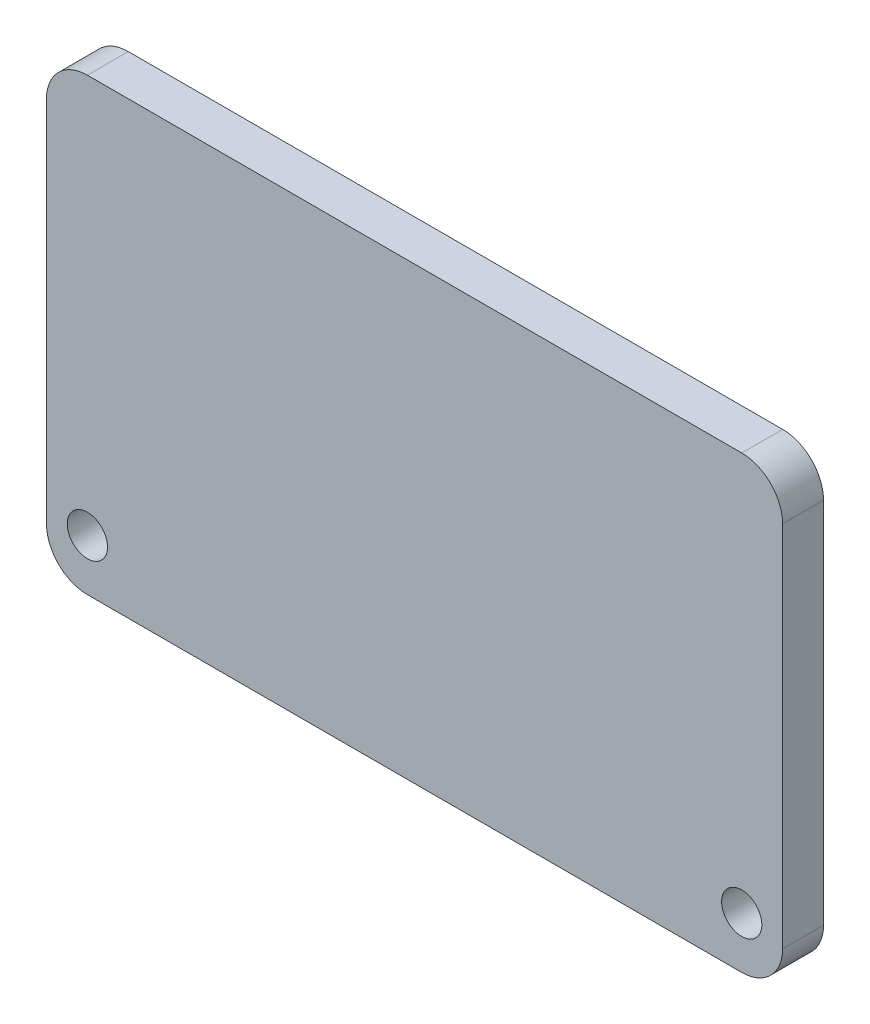
ISO-10303-21;
HEADER;
FILE_DESCRIPTION(('STEP AP214'),'2;1');
FILE_NAME('part.step','',(''),(''),'','','');
FILE_SCHEMA(('AUTOMOTIVE_DESIGN { 1 0 10303 214 1 1 1 1 }'));
ENDSEC;
DATA;
#1=APPLICATION_CONTEXT('core data for automotive mechanical design processes');
#2=APPLICATION_PROTOCOL_DEFINITION('international standard','automotive_design',2000,#1);
#3=PRODUCT_CONTEXT('',#1,'mechanical');
#4=PRODUCT('Part','Part','',(#3));
#5=PRODUCT_RELATED_PRODUCT_CATEGORY('part','',(#4));
#6=PRODUCT_DEFINITION_FORMATION('','',#4);
#7=PRODUCT_DEFINITION_CONTEXT('part definition',#1,'design');
#8=PRODUCT_DEFINITION('design','',#6,#7);
#9=PRODUCT_DEFINITION_SHAPE('','',#8);
#10=(LENGTH_UNIT() NAMED_UNIT(*) SI_UNIT(.MILLI.,.METRE.));
#11=(NAMED_UNIT(*) PLANE_ANGLE_UNIT() SI_UNIT($,.RADIAN.));
#12=(NAMED_UNIT(*) SI_UNIT($,.STERADIAN.) SOLID_ANGLE_UNIT());
#13=UNCERTAINTY_MEASURE_WITH_UNIT(LENGTH_MEASURE(1.E-05),#10,'distance_accuracy_value','');
#14=(GEOMETRIC_REPRESENTATION_CONTEXT(3) GLOBAL_UNCERTAINTY_ASSIGNED_CONTEXT((#13)) GLOBAL_UNIT_ASSIGNED_CONTEXT((#10,
#11,#12)) REPRESENTATION_CONTEXT('',''));
#15=CARTESIAN_POINT('',(0.,0.,0.));
#16=DIRECTION('',(0.,0.,1.));
#17=DIRECTION('',(1.,0.,0.));
#18=AXIS2_PLACEMENT_3D('',#15,#16,#17);
#19=CARTESIAN_POINT('',(22.86,-13.97,1.27));
#20=DIRECTION('',(-1.,0.,0.));
#21=DIRECTION('',(0.,0.,1.));
#22=AXIS2_PLACEMENT_3D('',#19,#20,#21);
#23=PLANE('',#22);
#24=DIRECTION('',(0.,1.,0.));
#25=VECTOR('',#24,1.);
#26=CARTESIAN_POINT('',(22.86,-13.97,-1.27));
#27=LINE('',#26,#25);
#28=CARTESIAN_POINT('',(22.86,-11.43,-1.27));
#29=VERTEX_POINT('',#28);
#30=CARTESIAN_POINT('',(22.86,11.43,-1.27));
#31=VERTEX_POINT('',#30);
#32=EDGE_CURVE('E126',#29,#31,#27,.T.);
#33=ORIENTED_EDGE('',*,*,#32,.T.);
#34=DIRECTION('',(0.,0.,-1.));
#35=VECTOR('',#34,1.);
#36=CARTESIAN_POINT('',(22.86,11.43,1.27));
#37=LINE('',#36,#35);
#38=CARTESIAN_POINT('',(22.86,11.43,1.27));
#39=VERTEX_POINT('',#38);
#40=EDGE_CURVE('E104',#31,#39,#37,.F.);
#41=ORIENTED_EDGE('',*,*,#40,.T.);
#42=DIRECTION('',(0.,1.,0.));
#43=VECTOR('',#42,1.);
#44=CARTESIAN_POINT('',(22.86,-13.97,1.27));
#45=LINE('',#44,#43);
#46=CARTESIAN_POINT('',(22.86,-11.43,1.27));
#47=VERTEX_POINT('',#46);
#48=EDGE_CURVE('E136',#47,#39,#45,.T.);
#49=ORIENTED_EDGE('',*,*,#48,.F.);
#50=DIRECTION('',(0.,0.,-1.));
#51=VECTOR('',#50,1.);
#52=CARTESIAN_POINT('',(22.86,-11.43,1.27));
#53=LINE('',#52,#51);
#54=EDGE_CURVE('E109',#47,#29,#53,.T.);
#55=ORIENTED_EDGE('',*,*,#54,.T.);
#56=EDGE_LOOP('',(#33,#41,#49,#55));
#57=FACE_BOUND('',#56,.T.);
#58=ADVANCED_FACE('F33',(#57),#23,.F.);
#59=CARTESIAN_POINT('',(-22.86,13.97,1.27));
#60=DIRECTION('',(0.,-1.,0.));
#61=DIRECTION('',(0.,0.,-1.));
#62=AXIS2_PLACEMENT_3D('',#59,#60,#61);
#63=PLANE('',#62);
#64=DIRECTION('',(-1.,0.,0.));
#65=VECTOR('',#64,1.);
#66=CARTESIAN_POINT('',(-22.86,13.97,1.27));
#67=LINE('',#66,#65);
#68=CARTESIAN_POINT('',(20.32,13.97,1.27));
#69=VERTEX_POINT('',#68);
#70=CARTESIAN_POINT('',(-20.32,13.97,1.27));
#71=VERTEX_POINT('',#70);
#72=EDGE_CURVE('E119',#69,#71,#67,.T.);
#73=ORIENTED_EDGE('',*,*,#72,.F.);
#74=DIRECTION('',(0.,0.,-1.));
#75=VECTOR('',#74,1.);
#76=CARTESIAN_POINT('',(20.32,13.97,1.27));
#77=LINE('',#76,#75);
#78=CARTESIAN_POINT('',(20.32,13.97,-1.27));
#79=VERTEX_POINT('',#78);
#80=EDGE_CURVE('E103',#69,#79,#77,.T.);
#81=ORIENTED_EDGE('',*,*,#80,.T.);
#82=DIRECTION('',(-1.,0.,0.));
#83=VECTOR('',#82,1.);
#84=CARTESIAN_POINT('',(-22.86,13.97,-1.27));
#85=LINE('',#84,#83);
#86=CARTESIAN_POINT('',(-20.32,13.97,-1.27));
#87=VERTEX_POINT('',#86);
#88=EDGE_CURVE('E116',#79,#87,#85,.T.);
#89=ORIENTED_EDGE('',*,*,#88,.T.);
#90=DIRECTION('',(0.,0.,-1.));
#91=VECTOR('',#90,1.);
#92=CARTESIAN_POINT('',(-20.32,13.97,1.27));
#93=LINE('',#92,#91);
#94=EDGE_CURVE('E121',#87,#71,#93,.F.);
#95=ORIENTED_EDGE('',*,*,#94,.T.);
#96=EDGE_LOOP('',(#73,#81,#89,#95));
#97=FACE_BOUND('',#96,.T.);
#98=ADVANCED_FACE('F115',(#97),#63,.F.);
#99=CARTESIAN_POINT('',(-22.86,-13.97,1.27));
#100=DIRECTION('',(1.,0.,0.));
#101=DIRECTION('',(0.,0.,-1.));
#102=AXIS2_PLACEMENT_3D('',#99,#100,#101);
#103=PLANE('',#102);
#104=DIRECTION('',(0.,-1.,0.));
#105=VECTOR('',#104,1.);
#106=CARTESIAN_POINT('',(-22.86,-13.97,-1.27));
#107=LINE('',#106,#105);
#108=CARTESIAN_POINT('',(-22.86,11.43,-1.27));
#109=VERTEX_POINT('',#108);
#110=CARTESIAN_POINT('',(-22.86,-11.43,-1.27));
#111=VERTEX_POINT('',#110);
#112=EDGE_CURVE('E125',#109,#111,#107,.T.);
#113=ORIENTED_EDGE('',*,*,#112,.T.);
#114=DIRECTION('',(0.,0.,-1.));
#115=VECTOR('',#114,1.);
#116=CARTESIAN_POINT('',(-22.86,-11.43,1.27));
#117=LINE('',#116,#115);
#118=CARTESIAN_POINT('',(-22.86,-11.43,1.27));
#119=VERTEX_POINT('',#118);
#120=EDGE_CURVE('E11',#111,#119,#117,.F.);
#121=ORIENTED_EDGE('',*,*,#120,.T.);
#122=DIRECTION('',(0.,-1.,0.));
#123=VECTOR('',#122,1.);
#124=CARTESIAN_POINT('',(-22.86,-13.97,1.27));
#125=LINE('',#124,#123);
#126=CARTESIAN_POINT('',(-22.86,11.43,1.27));
#127=VERTEX_POINT('',#126);
#128=EDGE_CURVE('E162',#127,#119,#125,.T.);
#129=ORIENTED_EDGE('',*,*,#128,.F.);
#130=DIRECTION('',(0.,0.,-1.));
#131=VECTOR('',#130,1.);
#132=CARTESIAN_POINT('',(-22.86,11.43,1.27));
#133=LINE('',#132,#131);
#134=EDGE_CURVE('E41',#127,#109,#133,.T.);
#135=ORIENTED_EDGE('',*,*,#134,.T.);
#136=EDGE_LOOP('',(#113,#121,#129,#135));
#137=FACE_BOUND('',#136,.T.);
#138=ADVANCED_FACE('F160',(#137),#103,.F.);
#139=CARTESIAN_POINT('',(-22.86,-13.97,1.27));
#140=DIRECTION('',(0.,1.,0.));
#141=DIRECTION('',(0.,0.,1.));
#142=AXIS2_PLACEMENT_3D('',#139,#140,#141);
#143=PLANE('',#142);
#144=DIRECTION('',(1.,0.,0.));
#145=VECTOR('',#144,1.);
#146=CARTESIAN_POINT('',(-22.86,-13.97,-1.27));
#147=LINE('',#146,#145);
#148=CARTESIAN_POINT('',(-20.32,-13.97,-1.27));
#149=VERTEX_POINT('',#148);
#150=CARTESIAN_POINT('',(20.32,-13.97,-1.27));
#151=VERTEX_POINT('',#150);
#152=EDGE_CURVE('E129',#149,#151,#147,.T.);
#153=ORIENTED_EDGE('',*,*,#152,.T.);
#154=DIRECTION('',(0.,0.,-1.));
#155=VECTOR('',#154,1.);
#156=CARTESIAN_POINT('',(20.32,-13.97,1.27));
#157=LINE('',#156,#155);
#158=CARTESIAN_POINT('',(20.32,-13.97,1.27));
#159=VERTEX_POINT('',#158);
#160=EDGE_CURVE('E48',#151,#159,#157,.F.);
#161=ORIENTED_EDGE('',*,*,#160,.T.);
#162=DIRECTION('',(1.,0.,0.));
#163=VECTOR('',#162,1.);
#164=CARTESIAN_POINT('',(-22.86,-13.97,1.27));
#165=LINE('',#164,#163);
#166=CARTESIAN_POINT('',(-20.32,-13.97,1.27));
#167=VERTEX_POINT('',#166);
#168=EDGE_CURVE('E137',#167,#159,#165,.T.);
#169=ORIENTED_EDGE('',*,*,#168,.F.);
#170=DIRECTION('',(0.,0.,-1.));
#171=VECTOR('',#170,1.);
#172=CARTESIAN_POINT('',(-20.32,-13.97,1.27));
#173=LINE('',#172,#171);
#174=EDGE_CURVE('E153',#167,#149,#173,.T.);
#175=ORIENTED_EDGE('',*,*,#174,.T.);
#176=EDGE_LOOP('',(#153,#161,#169,#175));
#177=FACE_BOUND('',#176,.T.);
#178=ADVANCED_FACE('F169',(#177),#143,.F.);
#179=CARTESIAN_POINT('',(0.,0.,1.27));
#180=DIRECTION('',(0.,0.,-1.));
#181=DIRECTION('',(-1.,0.,0.));
#182=AXIS2_PLACEMENT_3D('',#179,#180,#181);
#183=PLANE('',#182);
#184=CARTESIAN_POINT('',(20.32,-10.7857920790764,1.27));
#185=DIRECTION('',(0.,0.,1.));
#186=DIRECTION('',(1.,0.,0.));
#187=AXIS2_PLACEMENT_3D('',#184,#185,#186);
#188=CIRCLE('',#187,1.25);
#189=CARTESIAN_POINT('',(21.57,-10.7857920790764,1.27));
#190=VERTEX_POINT('',#189);
#191=EDGE_CURVE('E182',#190,#190,#188,.T.);
#192=ORIENTED_EDGE('',*,*,#191,.F.);
#193=EDGE_LOOP('',(#192));
#194=FACE_BOUND('',#193,.T.);
#195=CARTESIAN_POINT('',(-20.32,-10.7857920790764,1.27));
#196=DIRECTION('',(0.,0.,1.));
#197=DIRECTION('',(1.,0.,0.));
#198=AXIS2_PLACEMENT_3D('',#195,#196,#197);
#199=CIRCLE('',#198,1.25);
#200=CARTESIAN_POINT('',(-19.07,-10.7857920790764,1.27));
#201=VERTEX_POINT('',#200);
#202=EDGE_CURVE('E176',#201,#201,#199,.T.);
#203=ORIENTED_EDGE('',*,*,#202,.F.);
#204=EDGE_LOOP('',(#203));
#205=FACE_BOUND('',#204,.T.);
#206=ORIENTED_EDGE('',*,*,#48,.T.);
#207=CARTESIAN_POINT('',(20.32,11.43,1.27));
#208=DIRECTION('',(0.,0.,-1.));
#209=DIRECTION('',(-1.,0.,0.));
#210=AXIS2_PLACEMENT_3D('',#207,#208,#209);
#211=CIRCLE('',#210,2.54);
#212=EDGE_CURVE('E151',#39,#69,#211,.F.);
#213=ORIENTED_EDGE('',*,*,#212,.T.);
#214=ORIENTED_EDGE('',*,*,#72,.T.);
#215=CARTESIAN_POINT('',(-20.32,11.43,1.27));
#216=DIRECTION('',(0.,0.,-1.));
#217=DIRECTION('',(-1.,0.,0.));
#218=AXIS2_PLACEMENT_3D('',#215,#216,#217);
#219=CIRCLE('',#218,2.54);
#220=EDGE_CURVE('E146',#71,#127,#219,.F.);
#221=ORIENTED_EDGE('',*,*,#220,.T.);
#222=ORIENTED_EDGE('',*,*,#128,.T.);
#223=CARTESIAN_POINT('',(-20.32,-11.43,1.27));
#224=DIRECTION('',(0.,0.,-1.));
#225=DIRECTION('',(-1.,0.,0.));
#226=AXIS2_PLACEMENT_3D('',#223,#224,#225);
#227=CIRCLE('',#226,2.54);
#228=EDGE_CURVE('E55',#119,#167,#227,.F.);
#229=ORIENTED_EDGE('',*,*,#228,.T.);
#230=ORIENTED_EDGE('',*,*,#168,.T.);
#231=CARTESIAN_POINT('',(20.32,-11.43,1.27));
#232=DIRECTION('',(0.,0.,-1.));
#233=DIRECTION('',(-1.,0.,0.));
#234=AXIS2_PLACEMENT_3D('',#231,#232,#233);
#235=CIRCLE('',#234,2.54);
#236=EDGE_CURVE('E149',#159,#47,#235,.F.);
#237=ORIENTED_EDGE('',*,*,#236,.T.);
#238=EDGE_LOOP('',(#206,#213,#214,#221,#222,#229,#230,#237));
#239=FACE_BOUND('',#238,.T.);
#240=ADVANCED_FACE('F197',(#194,#205,#239),#183,.F.);
#241=CARTESIAN_POINT('',(0.,0.,-1.27));
#242=DIRECTION('',(0.,0.,-1.));
#243=DIRECTION('',(-1.,0.,0.));
#244=AXIS2_PLACEMENT_3D('',#241,#242,#243);
#245=PLANE('',#244);
#246=CARTESIAN_POINT('',(20.32,-10.7857920790764,-1.27));
#247=DIRECTION('',(0.,0.,1.));
#248=DIRECTION('',(1.,0.,0.));
#249=AXIS2_PLACEMENT_3D('',#246,#247,#248);
#250=CIRCLE('',#249,1.25);
#251=CARTESIAN_POINT('',(21.57,-10.7857920790764,-1.27));
#252=VERTEX_POINT('',#251);
#253=EDGE_CURVE('E179',#252,#252,#250,.T.);
#254=ORIENTED_EDGE('',*,*,#253,.T.);
#255=EDGE_LOOP('',(#254));
#256=FACE_BOUND('',#255,.T.);
#257=CARTESIAN_POINT('',(-20.32,-10.7857920790764,-1.27));
#258=DIRECTION('',(0.,0.,1.));
#259=DIRECTION('',(1.,0.,0.));
#260=AXIS2_PLACEMENT_3D('',#257,#258,#259);
#261=CIRCLE('',#260,1.25);
#262=CARTESIAN_POINT('',(-19.07,-10.7857920790764,-1.27));
#263=VERTEX_POINT('',#262);
#264=EDGE_CURVE('E131',#263,#263,#261,.T.);
#265=ORIENTED_EDGE('',*,*,#264,.T.);
#266=EDGE_LOOP('',(#265));
#267=FACE_BOUND('',#266,.T.);
#268=ORIENTED_EDGE('',*,*,#88,.F.);
#269=CARTESIAN_POINT('',(20.32,11.43,-1.27));
#270=DIRECTION('',(0.,0.,-1.));
#271=DIRECTION('',(-1.,0.,0.));
#272=AXIS2_PLACEMENT_3D('',#269,#270,#271);
#273=CIRCLE('',#272,2.54);
#274=EDGE_CURVE('E99',#79,#31,#273,.T.);
#275=ORIENTED_EDGE('',*,*,#274,.T.);
#276=ORIENTED_EDGE('',*,*,#32,.F.);
#277=CARTESIAN_POINT('',(20.32,-11.43,-1.27));
#278=DIRECTION('',(0.,0.,-1.));
#279=DIRECTION('',(-1.,0.,0.));
#280=AXIS2_PLACEMENT_3D('',#277,#278,#279);
#281=CIRCLE('',#280,2.54);
#282=EDGE_CURVE('E110',#29,#151,#281,.T.);
#283=ORIENTED_EDGE('',*,*,#282,.T.);
#284=ORIENTED_EDGE('',*,*,#152,.F.);
#285=CARTESIAN_POINT('',(-20.32,-11.43,-1.27));
#286=DIRECTION('',(0.,0.,-1.));
#287=DIRECTION('',(-1.,0.,0.));
#288=AXIS2_PLACEMENT_3D('',#285,#286,#287);
#289=CIRCLE('',#288,2.54);
#290=EDGE_CURVE('E140',#149,#111,#289,.T.);
#291=ORIENTED_EDGE('',*,*,#290,.T.);
#292=ORIENTED_EDGE('',*,*,#112,.F.);
#293=CARTESIAN_POINT('',(-20.32,11.43,-1.27));
#294=DIRECTION('',(0.,0.,-1.));
#295=DIRECTION('',(-1.,0.,0.));
#296=AXIS2_PLACEMENT_3D('',#293,#294,#295);
#297=CIRCLE('',#296,2.54);
#298=EDGE_CURVE('E120',#109,#87,#297,.T.);
#299=ORIENTED_EDGE('',*,*,#298,.T.);
#300=EDGE_LOOP('',(#268,#275,#276,#283,#284,#291,#292,#299));
#301=FACE_BOUND('',#300,.T.);
#302=ADVANCED_FACE('F123',(#256,#267,#301),#245,.T.);
#303=CARTESIAN_POINT('',(20.32,11.43,1.27));
#304=DIRECTION('',(0.,0.,-1.));
#305=DIRECTION('',(-1.,0.,0.));
#306=AXIS2_PLACEMENT_3D('',#303,#304,#305);
#307=CYLINDRICAL_SURFACE('',#306,2.54);
#308=ORIENTED_EDGE('',*,*,#212,.F.);
#309=ORIENTED_EDGE('',*,*,#40,.F.);
#310=ORIENTED_EDGE('',*,*,#274,.F.);
#311=ORIENTED_EDGE('',*,*,#80,.F.);
#312=EDGE_LOOP('',(#308,#309,#310,#311));
#313=FACE_BOUND('',#312,.T.);
#314=ADVANCED_FACE('F102',(#313),#307,.T.);
#315=CARTESIAN_POINT('',(20.32,-11.43,1.27));
#316=DIRECTION('',(0.,0.,-1.));
#317=DIRECTION('',(-1.,0.,0.));
#318=AXIS2_PLACEMENT_3D('',#315,#316,#317);
#319=CYLINDRICAL_SURFACE('',#318,2.54);
#320=ORIENTED_EDGE('',*,*,#236,.F.);
#321=ORIENTED_EDGE('',*,*,#160,.F.);
#322=ORIENTED_EDGE('',*,*,#282,.F.);
#323=ORIENTED_EDGE('',*,*,#54,.F.);
#324=EDGE_LOOP('',(#320,#321,#322,#323));
#325=FACE_BOUND('',#324,.T.);
#326=ADVANCED_FACE('F206',(#325),#319,.T.);
#327=CARTESIAN_POINT('',(-20.32,-11.43,1.27));
#328=DIRECTION('',(0.,0.,-1.));
#329=DIRECTION('',(-1.,0.,0.));
#330=AXIS2_PLACEMENT_3D('',#327,#328,#329);
#331=CYLINDRICAL_SURFACE('',#330,2.54);
#332=ORIENTED_EDGE('',*,*,#228,.F.);
#333=ORIENTED_EDGE('',*,*,#120,.F.);
#334=ORIENTED_EDGE('',*,*,#290,.F.);
#335=ORIENTED_EDGE('',*,*,#174,.F.);
#336=EDGE_LOOP('',(#332,#333,#334,#335));
#337=FACE_BOUND('',#336,.T.);
#338=ADVANCED_FACE('F168',(#337),#331,.T.);
#339=CARTESIAN_POINT('',(-20.32,11.43,1.27));
#340=DIRECTION('',(0.,0.,-1.));
#341=DIRECTION('',(-1.,0.,0.));
#342=AXIS2_PLACEMENT_3D('',#339,#340,#341);
#343=CYLINDRICAL_SURFACE('',#342,2.54);
#344=ORIENTED_EDGE('',*,*,#220,.F.);
#345=ORIENTED_EDGE('',*,*,#94,.F.);
#346=ORIENTED_EDGE('',*,*,#298,.F.);
#347=ORIENTED_EDGE('',*,*,#134,.F.);
#348=EDGE_LOOP('',(#344,#345,#346,#347));
#349=FACE_BOUND('',#348,.T.);
#350=ADVANCED_FACE('F35',(#349),#343,.T.);
#351=CARTESIAN_POINT('',(-20.32,-10.7857920790764,-1.27));
#352=DIRECTION('',(0.,0.,1.));
#353=DIRECTION('',(1.,0.,0.));
#354=AXIS2_PLACEMENT_3D('',#351,#352,#353);
#355=CYLINDRICAL_SURFACE('',#354,1.25);
#356=ORIENTED_EDGE('',*,*,#264,.F.);
#357=EDGE_LOOP('',(#356));
#358=FACE_BOUND('',#357,.T.);
#359=ORIENTED_EDGE('',*,*,#202,.T.);
#360=EDGE_LOOP('',(#359));
#361=FACE_BOUND('',#360,.T.);
#362=ADVANCED_FACE('F193',(#358,#361),#355,.F.);
#363=CARTESIAN_POINT('',(20.32,-10.7857920790764,-1.27));
#364=DIRECTION('',(0.,0.,1.));
#365=DIRECTION('',(1.,0.,0.));
#366=AXIS2_PLACEMENT_3D('',#363,#364,#365);
#367=CYLINDRICAL_SURFACE('',#366,1.25);
#368=ORIENTED_EDGE('',*,*,#253,.F.);
#369=EDGE_LOOP('',(#368));
#370=FACE_BOUND('',#369,.T.);
#371=ORIENTED_EDGE('',*,*,#191,.T.);
#372=EDGE_LOOP('',(#371));
#373=FACE_BOUND('',#372,.T.);
#374=ADVANCED_FACE('F190',(#370,#373),#367,.F.);
#375=CLOSED_SHELL('',(#58,#98,#138,#178,#240,#302,#314,#326,#338,#350,#362,#374));
#376=MANIFOLD_SOLID_BREP('B2',#375);
#377=ADVANCED_BREP_SHAPE_REPRESENTATION('',(#18,#376),#14);
#378=SHAPE_DEFINITION_REPRESENTATION(#9,#377);
ENDSEC;
END-ISO-10303-21;
